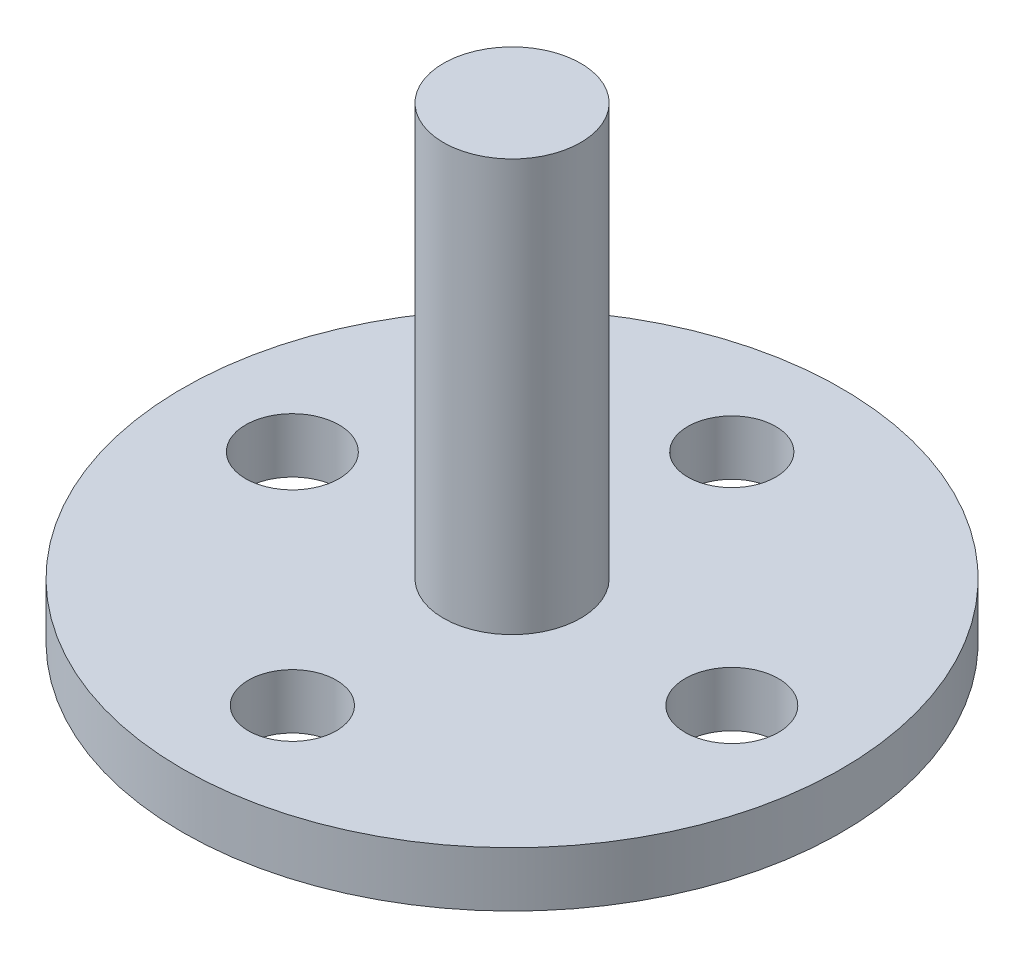
ISO-10303-21;
HEADER;
FILE_DESCRIPTION(('STEP AP214'),'2;1');
FILE_NAME('part.step','',(''),(''),'','','');
FILE_SCHEMA(('AUTOMOTIVE_DESIGN { 1 0 10303 214 1 1 1 1 }'));
ENDSEC;
DATA;
#1=APPLICATION_CONTEXT('core data for automotive mechanical design processes');
#2=APPLICATION_PROTOCOL_DEFINITION('international standard','automotive_design',2000,#1);
#3=PRODUCT_CONTEXT('',#1,'mechanical');
#4=PRODUCT('Part','Part','',(#3));
#5=PRODUCT_RELATED_PRODUCT_CATEGORY('part','',(#4));
#6=PRODUCT_DEFINITION_FORMATION('','',#4);
#7=PRODUCT_DEFINITION_CONTEXT('part definition',#1,'design');
#8=PRODUCT_DEFINITION('design','',#6,#7);
#9=PRODUCT_DEFINITION_SHAPE('','',#8);
#10=(LENGTH_UNIT() NAMED_UNIT(*) SI_UNIT(.MILLI.,.METRE.));
#11=(NAMED_UNIT(*) PLANE_ANGLE_UNIT() SI_UNIT($,.RADIAN.));
#12=(NAMED_UNIT(*) SI_UNIT($,.STERADIAN.) SOLID_ANGLE_UNIT());
#13=UNCERTAINTY_MEASURE_WITH_UNIT(LENGTH_MEASURE(1.E-05),#10,'distance_accuracy_value','');
#14=(GEOMETRIC_REPRESENTATION_CONTEXT(3) GLOBAL_UNCERTAINTY_ASSIGNED_CONTEXT((#13)) GLOBAL_UNIT_ASSIGNED_CONTEXT((#10,
#11,#12)) REPRESENTATION_CONTEXT('',''));
#15=CARTESIAN_POINT('',(0.,0.,0.));
#16=DIRECTION('',(0.,0.,1.));
#17=DIRECTION('',(1.,0.,0.));
#18=AXIS2_PLACEMENT_3D('',#15,#16,#17);
#19=CARTESIAN_POINT('',(0.,2.,0.));
#20=DIRECTION('',(0.,1.,0.));
#21=DIRECTION('',(0.,0.,1.));
#22=AXIS2_PLACEMENT_3D('',#19,#20,#21);
#23=PLANE('',#22);
#24=CARTESIAN_POINT('',(0.,2.,0.));
#25=DIRECTION('',(0.,1.,0.));
#26=DIRECTION('',(0.,0.,1.));
#27=AXIS2_PLACEMENT_3D('',#24,#25,#26);
#28=CIRCLE('',#27,2.5);
#29=CARTESIAN_POINT('',(0.,2.,2.5));
#30=VERTEX_POINT('',#29);
#31=EDGE_CURVE('E84',#30,#30,#28,.T.);
#32=ORIENTED_EDGE('',*,*,#31,.F.);
#33=EDGE_LOOP('',(#32));
#34=FACE_BOUND('',#33,.T.);
#35=CARTESIAN_POINT('',(8.,2.,0.));
#36=DIRECTION('',(0.,1.,0.));
#37=DIRECTION('',(0.,0.,1.));
#38=AXIS2_PLACEMENT_3D('',#35,#36,#37);
#39=CIRCLE('',#38,1.7);
#40=CARTESIAN_POINT('',(8.,2.,1.7));
#41=VERTEX_POINT('',#40);
#42=EDGE_CURVE('E64',#41,#41,#39,.T.);
#43=ORIENTED_EDGE('',*,*,#42,.F.);
#44=EDGE_LOOP('',(#43));
#45=FACE_BOUND('',#44,.T.);
#46=CARTESIAN_POINT('',(-8.,2.,0.));
#47=DIRECTION('',(0.,1.,0.));
#48=DIRECTION('',(0.,0.,1.));
#49=AXIS2_PLACEMENT_3D('',#46,#47,#48);
#50=CIRCLE('',#49,1.7);
#51=CARTESIAN_POINT('',(-8.,2.,1.7));
#52=VERTEX_POINT('',#51);
#53=EDGE_CURVE('E50',#52,#52,#50,.T.);
#54=ORIENTED_EDGE('',*,*,#53,.F.);
#55=EDGE_LOOP('',(#54));
#56=FACE_BOUND('',#55,.T.);
#57=CARTESIAN_POINT('',(0.,2.,0.));
#58=DIRECTION('',(0.,1.,0.));
#59=DIRECTION('',(0.,0.,1.));
#60=AXIS2_PLACEMENT_3D('',#57,#58,#59);
#61=CIRCLE('',#60,12.);
#62=CARTESIAN_POINT('',(0.,2.,12.));
#63=VERTEX_POINT('',#62);
#64=EDGE_CURVE('E10',#63,#63,#61,.T.);
#65=ORIENTED_EDGE('',*,*,#64,.T.);
#66=EDGE_LOOP('',(#65));
#67=FACE_BOUND('',#66,.T.);
#68=CARTESIAN_POINT('',(0.,2.,-8.));
#69=DIRECTION('',(0.,1.,0.));
#70=DIRECTION('',(0.,0.,1.));
#71=AXIS2_PLACEMENT_3D('',#68,#69,#70);
#72=CIRCLE('',#71,1.6);
#73=CARTESIAN_POINT('',(0.,2.,-6.4));
#74=VERTEX_POINT('',#73);
#75=EDGE_CURVE('E56',#74,#74,#72,.T.);
#76=ORIENTED_EDGE('',*,*,#75,.F.);
#77=EDGE_LOOP('',(#76));
#78=FACE_BOUND('',#77,.T.);
#79=CARTESIAN_POINT('',(0.,2.,8.));
#80=DIRECTION('',(0.,1.,0.));
#81=DIRECTION('',(0.,0.,1.));
#82=AXIS2_PLACEMENT_3D('',#79,#80,#81);
#83=CIRCLE('',#82,1.6);
#84=CARTESIAN_POINT('',(0.,2.,9.6));
#85=VERTEX_POINT('',#84);
#86=EDGE_CURVE('E72',#85,#85,#83,.T.);
#87=ORIENTED_EDGE('',*,*,#86,.F.);
#88=EDGE_LOOP('',(#87));
#89=FACE_BOUND('',#88,.T.);
#90=ADVANCED_FACE('F37',(#34,#45,#56,#67,#78,#89),#23,.T.);
#91=CARTESIAN_POINT('',(0.,0.,0.));
#92=DIRECTION('',(0.,1.,0.));
#93=DIRECTION('',(0.,0.,1.));
#94=AXIS2_PLACEMENT_3D('',#91,#92,#93);
#95=PLANE('',#94);
#96=CARTESIAN_POINT('',(0.,0.,0.));
#97=DIRECTION('',(0.,1.,0.));
#98=DIRECTION('',(0.,0.,1.));
#99=AXIS2_PLACEMENT_3D('',#96,#97,#98);
#100=CIRCLE('',#99,12.);
#101=CARTESIAN_POINT('',(0.,0.,12.));
#102=VERTEX_POINT('',#101);
#103=EDGE_CURVE('E41',#102,#102,#100,.T.);
#104=ORIENTED_EDGE('',*,*,#103,.F.);
#105=EDGE_LOOP('',(#104));
#106=FACE_BOUND('',#105,.T.);
#107=CARTESIAN_POINT('',(-8.,0.,0.));
#108=DIRECTION('',(0.,1.,0.));
#109=DIRECTION('',(0.,0.,1.));
#110=AXIS2_PLACEMENT_3D('',#107,#108,#109);
#111=CIRCLE('',#110,1.7);
#112=CARTESIAN_POINT('',(-8.,0.,1.7));
#113=VERTEX_POINT('',#112);
#114=EDGE_CURVE('E52',#113,#113,#111,.T.);
#115=ORIENTED_EDGE('',*,*,#114,.T.);
#116=EDGE_LOOP('',(#115));
#117=FACE_BOUND('',#116,.T.);
#118=CARTESIAN_POINT('',(0.,0.,-8.));
#119=DIRECTION('',(0.,1.,0.));
#120=DIRECTION('',(0.,0.,1.));
#121=AXIS2_PLACEMENT_3D('',#118,#119,#120);
#122=CIRCLE('',#121,1.6);
#123=CARTESIAN_POINT('',(0.,0.,-6.4));
#124=VERTEX_POINT('',#123);
#125=EDGE_CURVE('E60',#124,#124,#122,.T.);
#126=ORIENTED_EDGE('',*,*,#125,.T.);
#127=EDGE_LOOP('',(#126));
#128=FACE_BOUND('',#127,.T.);
#129=CARTESIAN_POINT('',(8.,0.,0.));
#130=DIRECTION('',(0.,1.,0.));
#131=DIRECTION('',(0.,0.,1.));
#132=AXIS2_PLACEMENT_3D('',#129,#130,#131);
#133=CIRCLE('',#132,1.7);
#134=CARTESIAN_POINT('',(8.,0.,1.7));
#135=VERTEX_POINT('',#134);
#136=EDGE_CURVE('E68',#135,#135,#133,.T.);
#137=ORIENTED_EDGE('',*,*,#136,.T.);
#138=EDGE_LOOP('',(#137));
#139=FACE_BOUND('',#138,.T.);
#140=CARTESIAN_POINT('',(0.,0.,8.));
#141=DIRECTION('',(0.,1.,0.));
#142=DIRECTION('',(0.,0.,1.));
#143=AXIS2_PLACEMENT_3D('',#140,#141,#142);
#144=CIRCLE('',#143,1.6);
#145=CARTESIAN_POINT('',(0.,0.,9.6));
#146=VERTEX_POINT('',#145);
#147=EDGE_CURVE('E76',#146,#146,#144,.T.);
#148=ORIENTED_EDGE('',*,*,#147,.T.);
#149=EDGE_LOOP('',(#148));
#150=FACE_BOUND('',#149,.T.);
#151=ADVANCED_FACE('F103',(#106,#117,#128,#139,#150),#95,.F.);
#152=CARTESIAN_POINT('',(0.,2.,0.));
#153=DIRECTION('',(0.,-1.,0.));
#154=DIRECTION('',(0.,0.,-1.));
#155=AXIS2_PLACEMENT_3D('',#152,#153,#154);
#156=CYLINDRICAL_SURFACE('',#155,12.);
#157=ORIENTED_EDGE('',*,*,#64,.F.);
#158=EDGE_LOOP('',(#157));
#159=FACE_BOUND('',#158,.T.);
#160=ORIENTED_EDGE('',*,*,#103,.T.);
#161=EDGE_LOOP('',(#160));
#162=FACE_BOUND('',#161,.T.);
#163=ADVANCED_FACE('F39',(#159,#162),#156,.T.);
#164=CARTESIAN_POINT('',(-8.,2.,0.));
#165=DIRECTION('',(0.,-1.,0.));
#166=DIRECTION('',(0.,0.,-1.));
#167=AXIS2_PLACEMENT_3D('',#164,#165,#166);
#168=CYLINDRICAL_SURFACE('',#167,1.7);
#169=ORIENTED_EDGE('',*,*,#53,.T.);
#170=EDGE_LOOP('',(#169));
#171=FACE_BOUND('',#170,.T.);
#172=ORIENTED_EDGE('',*,*,#114,.F.);
#173=EDGE_LOOP('',(#172));
#174=FACE_BOUND('',#173,.T.);
#175=ADVANCED_FACE('F124',(#171,#174),#168,.F.);
#176=CARTESIAN_POINT('',(0.,2.,-8.));
#177=DIRECTION('',(0.,-1.,0.));
#178=DIRECTION('',(0.,0.,-1.));
#179=AXIS2_PLACEMENT_3D('',#176,#177,#178);
#180=CYLINDRICAL_SURFACE('',#179,1.6);
#181=ORIENTED_EDGE('',*,*,#75,.T.);
#182=EDGE_LOOP('',(#181));
#183=FACE_BOUND('',#182,.T.);
#184=ORIENTED_EDGE('',*,*,#125,.F.);
#185=EDGE_LOOP('',(#184));
#186=FACE_BOUND('',#185,.T.);
#187=ADVANCED_FACE('F131',(#183,#186),#180,.F.);
#188=CARTESIAN_POINT('',(8.,2.,0.));
#189=DIRECTION('',(0.,-1.,0.));
#190=DIRECTION('',(0.,0.,-1.));
#191=AXIS2_PLACEMENT_3D('',#188,#189,#190);
#192=CYLINDRICAL_SURFACE('',#191,1.7);
#193=ORIENTED_EDGE('',*,*,#42,.T.);
#194=EDGE_LOOP('',(#193));
#195=FACE_BOUND('',#194,.T.);
#196=ORIENTED_EDGE('',*,*,#136,.F.);
#197=EDGE_LOOP('',(#196));
#198=FACE_BOUND('',#197,.T.);
#199=ADVANCED_FACE('F115',(#195,#198),#192,.F.);
#200=CARTESIAN_POINT('',(0.,2.,8.));
#201=DIRECTION('',(0.,-1.,0.));
#202=DIRECTION('',(0.,0.,-1.));
#203=AXIS2_PLACEMENT_3D('',#200,#201,#202);
#204=CYLINDRICAL_SURFACE('',#203,1.6);
#205=ORIENTED_EDGE('',*,*,#86,.T.);
#206=EDGE_LOOP('',(#205));
#207=FACE_BOUND('',#206,.T.);
#208=ORIENTED_EDGE('',*,*,#147,.F.);
#209=EDGE_LOOP('',(#208));
#210=FACE_BOUND('',#209,.T.);
#211=ADVANCED_FACE('F97',(#207,#210),#204,.F.);
#212=CARTESIAN_POINT('',(0.,17.,0.));
#213=DIRECTION('',(0.,-1.,0.));
#214=DIRECTION('',(0.,0.,-1.));
#215=AXIS2_PLACEMENT_3D('',#212,#213,#214);
#216=CYLINDRICAL_SURFACE('',#215,2.5);
#217=CARTESIAN_POINT('',(0.,17.,0.));
#218=DIRECTION('',(0.,1.,0.));
#219=DIRECTION('',(0.,0.,1.));
#220=AXIS2_PLACEMENT_3D('',#217,#218,#219);
#221=CIRCLE('',#220,2.5);
#222=CARTESIAN_POINT('',(0.,17.,2.5));
#223=VERTEX_POINT('',#222);
#224=EDGE_CURVE('E80',#223,#223,#221,.T.);
#225=ORIENTED_EDGE('',*,*,#224,.F.);
#226=EDGE_LOOP('',(#225));
#227=FACE_BOUND('',#226,.T.);
#228=ORIENTED_EDGE('',*,*,#31,.T.);
#229=EDGE_LOOP('',(#228));
#230=FACE_BOUND('',#229,.T.);
#231=ADVANCED_FACE('F94',(#227,#230),#216,.T.);
#232=CARTESIAN_POINT('',(0.,17.,0.));
#233=DIRECTION('',(0.,1.,0.));
#234=DIRECTION('',(0.,0.,1.));
#235=AXIS2_PLACEMENT_3D('',#232,#233,#234);
#236=PLANE('',#235);
#237=ORIENTED_EDGE('',*,*,#224,.T.);
#238=EDGE_LOOP('',(#237));
#239=FACE_BOUND('',#238,.T.);
#240=ADVANCED_FACE('F92',(#239),#236,.T.);
#241=CLOSED_SHELL('',(#90,#151,#163,#175,#187,#199,#211,#231,#240));
#242=MANIFOLD_SOLID_BREP('B2',#241);
#243=ADVANCED_BREP_SHAPE_REPRESENTATION('',(#18,#242),#14);
#244=SHAPE_DEFINITION_REPRESENTATION(#9,#243);
ENDSEC;
END-ISO-10303-21;
